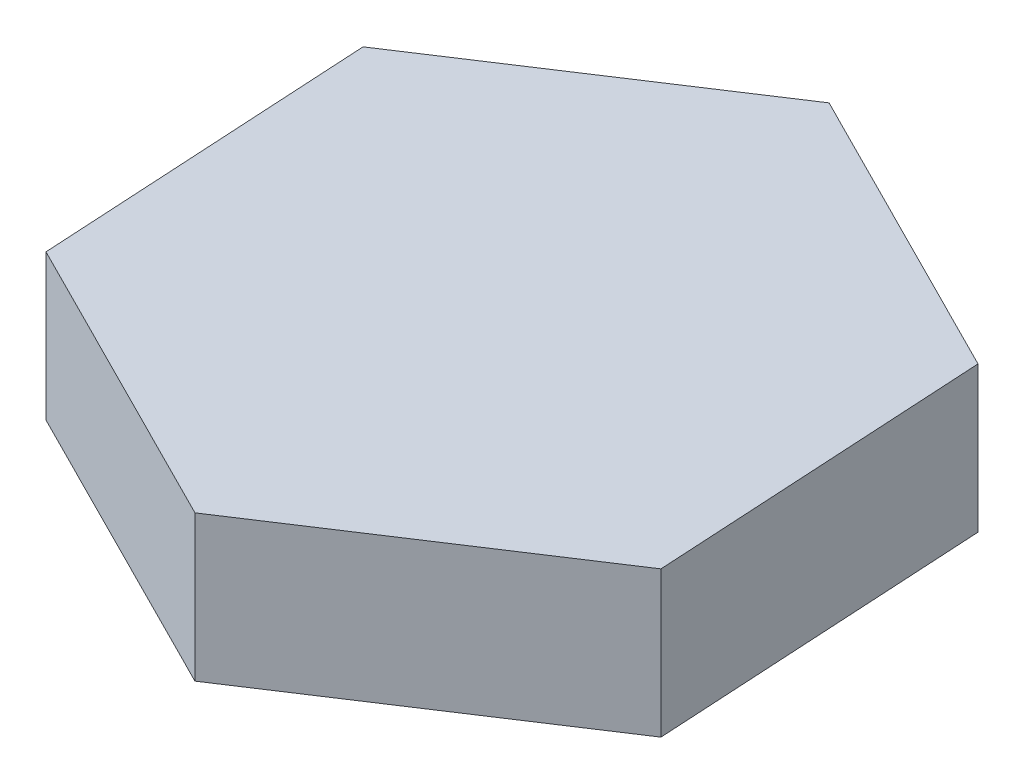
ISO-10303-21;
HEADER;
FILE_DESCRIPTION(('STEP AP214'),'2;1');
FILE_NAME('part.step','',(''),(''),'','','');
FILE_SCHEMA(('AUTOMOTIVE_DESIGN { 1 0 10303 214 1 1 1 1 }'));
ENDSEC;
DATA;
#1=APPLICATION_CONTEXT('core data for automotive mechanical design processes');
#2=APPLICATION_PROTOCOL_DEFINITION('international standard','automotive_design',2000,#1);
#3=PRODUCT_CONTEXT('',#1,'mechanical');
#4=PRODUCT('Part','Part','',(#3));
#5=PRODUCT_RELATED_PRODUCT_CATEGORY('part','',(#4));
#6=PRODUCT_DEFINITION_FORMATION('','',#4);
#7=PRODUCT_DEFINITION_CONTEXT('part definition',#1,'design');
#8=PRODUCT_DEFINITION('design','',#6,#7);
#9=PRODUCT_DEFINITION_SHAPE('','',#8);
#10=(LENGTH_UNIT() NAMED_UNIT(*) SI_UNIT(.MILLI.,.METRE.));
#11=(NAMED_UNIT(*) PLANE_ANGLE_UNIT() SI_UNIT($,.RADIAN.));
#12=(NAMED_UNIT(*) SI_UNIT($,.STERADIAN.) SOLID_ANGLE_UNIT());
#13=UNCERTAINTY_MEASURE_WITH_UNIT(LENGTH_MEASURE(1.E-05),#10,'distance_accuracy_value','');
#14=(GEOMETRIC_REPRESENTATION_CONTEXT(3) GLOBAL_UNCERTAINTY_ASSIGNED_CONTEXT((#13)) GLOBAL_UNIT_ASSIGNED_CONTEXT((#10,
#11,#12)) REPRESENTATION_CONTEXT('',''));
#15=CARTESIAN_POINT('',(0.,0.,0.));
#16=DIRECTION('',(0.,0.,1.));
#17=DIRECTION('',(1.,0.,0.));
#18=AXIS2_PLACEMENT_3D('',#15,#16,#17);
#19=CARTESIAN_POINT('',(78.5620604540912,38.1,39.6222495223042));
#20=DIRECTION('',(-0.998405284268621,0.,0.0564525317810732));
#21=DIRECTION('',(0.0564525317810732,0.,0.998405284268622));
#22=AXIS2_PLACEMENT_3D('',#19,#20,#21);
#23=PLANE('',#22);
#24=DIRECTION('',(-0.0564525317810732,0.,-0.998405284268622));
#25=VECTOR('',#24,1.);
#26=CARTESIAN_POINT('',(78.5620604540912,0.,39.6222495223042));
#27=LINE('',#26,#25);
#28=CARTESIAN_POINT('',(78.5620604540912,0.,39.6222495223042));
#29=VERTEX_POINT('',#28);
#30=CARTESIAN_POINT('',(73.5949048684468,0.,-48.2256153657397));
#31=VERTEX_POINT('',#30);
#32=EDGE_CURVE('E118',#29,#31,#27,.T.);
#33=ORIENTED_EDGE('',*,*,#32,.T.);
#34=DIRECTION('',(0.,-1.,0.));
#35=VECTOR('',#34,1.);
#36=CARTESIAN_POINT('',(73.5949048684468,38.1,-48.2256153657397));
#37=LINE('',#36,#35);
#38=CARTESIAN_POINT('',(73.5949048684468,38.1,-48.2256153657397));
#39=VERTEX_POINT('',#38);
#40=EDGE_CURVE('E11',#39,#31,#37,.T.);
#41=ORIENTED_EDGE('',*,*,#40,.F.);
#42=DIRECTION('',(-0.0564525317810732,0.,-0.998405284268622));
#43=VECTOR('',#42,1.);
#44=CARTESIAN_POINT('',(78.5620604540912,38.1,39.6222495223042));
#45=LINE('',#44,#43);
#46=CARTESIAN_POINT('',(78.5620604540912,38.1,39.6222495223042));
#47=VERTEX_POINT('',#46);
#48=EDGE_CURVE('E129',#47,#39,#45,.T.);
#49=ORIENTED_EDGE('',*,*,#48,.F.);
#50=DIRECTION('',(0.,-1.,0.));
#51=VECTOR('',#50,1.);
#52=CARTESIAN_POINT('',(78.5620604540912,38.1,39.6222495223042));
#53=LINE('',#52,#51);
#54=EDGE_CURVE('E114',#47,#29,#53,.T.);
#55=ORIENTED_EDGE('',*,*,#54,.T.);
#56=EDGE_LOOP('',(#33,#41,#49,#55));
#57=FACE_BOUND('',#56,.T.);
#58=ADVANCED_FACE('F34',(#57),#23,.F.);
#59=CARTESIAN_POINT('',(73.5949048684468,38.1,-48.2256153657397));
#60=DIRECTION('',(-0.450313315503953,0.,0.892870605339787));
#61=DIRECTION('',(0.892870605339787,0.,0.450313315503953));
#62=AXIS2_PLACEMENT_3D('',#59,#60,#61);
#63=PLANE('',#62);
#64=DIRECTION('',(-0.892870605339787,0.,-0.450313315503953));
#65=VECTOR('',#64,1.);
#66=CARTESIAN_POINT('',(73.5949048684468,0.,-48.2256153657397));
#67=LINE('',#66,#65);
#68=CARTESIAN_POINT('',(-4.96715558564432,0.,-87.8478648880439));
#69=VERTEX_POINT('',#68);
#70=EDGE_CURVE('E121',#31,#69,#67,.T.);
#71=ORIENTED_EDGE('',*,*,#70,.T.);
#72=DIRECTION('',(0.,-1.,0.));
#73=VECTOR('',#72,1.);
#74=CARTESIAN_POINT('',(-4.96715558564432,38.1,-87.8478648880439));
#75=LINE('',#74,#73);
#76=CARTESIAN_POINT('',(-4.96715558564432,38.1,-87.8478648880439));
#77=VERTEX_POINT('',#76);
#78=EDGE_CURVE('E42',#77,#69,#75,.T.);
#79=ORIENTED_EDGE('',*,*,#78,.F.);
#80=DIRECTION('',(-0.892870605339787,0.,-0.450313315503953));
#81=VECTOR('',#80,1.);
#82=CARTESIAN_POINT('',(73.5949048684468,38.1,-48.2256153657397));
#83=LINE('',#82,#81);
#84=EDGE_CURVE('E87',#39,#77,#83,.T.);
#85=ORIENTED_EDGE('',*,*,#84,.F.);
#86=ORIENTED_EDGE('',*,*,#40,.T.);
#87=EDGE_LOOP('',(#71,#79,#85,#86));
#88=FACE_BOUND('',#87,.T.);
#89=ADVANCED_FACE('F153',(#88),#63,.F.);
#90=CARTESIAN_POINT('',(-4.96715558564432,38.1,-87.8478648880439));
#91=DIRECTION('',(0.548091968764669,0.,0.836418073558713));
#92=DIRECTION('',(0.836418073558713,0.,-0.548091968764669));
#93=AXIS2_PLACEMENT_3D('',#90,#91,#92);
#94=PLANE('',#93);
#95=DIRECTION('',(-0.836418073558713,0.,0.548091968764669));
#96=VECTOR('',#95,1.);
#97=CARTESIAN_POINT('',(-4.96715558564432,0.,-87.8478648880439));
#98=LINE('',#97,#96);
#99=CARTESIAN_POINT('',(-78.5620604540912,0.,-39.6222495223041));
#100=VERTEX_POINT('',#99);
#101=EDGE_CURVE('E124',#69,#100,#98,.T.);
#102=ORIENTED_EDGE('',*,*,#101,.T.);
#103=DIRECTION('',(0.,-1.,0.));
#104=VECTOR('',#103,1.);
#105=CARTESIAN_POINT('',(-78.5620604540912,38.1,-39.6222495223041));
#106=LINE('',#105,#104);
#107=CARTESIAN_POINT('',(-78.5620604540912,38.1,-39.6222495223041));
#108=VERTEX_POINT('',#107);
#109=EDGE_CURVE('E109',#108,#100,#106,.T.);
#110=ORIENTED_EDGE('',*,*,#109,.F.);
#111=DIRECTION('',(-0.836418073558713,0.,0.548091968764669));
#112=VECTOR('',#111,1.);
#113=CARTESIAN_POINT('',(-4.96715558564432,38.1,-87.8478648880439));
#114=LINE('',#113,#112);
#115=EDGE_CURVE('E100',#77,#108,#114,.T.);
#116=ORIENTED_EDGE('',*,*,#115,.F.);
#117=ORIENTED_EDGE('',*,*,#78,.T.);
#118=EDGE_LOOP('',(#102,#110,#116,#117));
#119=FACE_BOUND('',#118,.T.);
#120=ADVANCED_FACE('F135',(#119),#94,.F.);
#121=CARTESIAN_POINT('',(-78.5620604540912,38.1,-39.6222495223041));
#122=DIRECTION('',(0.998405284268621,0.,-0.0564525317810734));
#123=DIRECTION('',(-0.0564525317810734,0.,-0.998405284268622));
#124=AXIS2_PLACEMENT_3D('',#121,#122,#123);
#125=PLANE('',#124);
#126=DIRECTION('',(0.0564525317810734,0.,0.998405284268622));
#127=VECTOR('',#126,1.);
#128=CARTESIAN_POINT('',(-78.5620604540912,0.,-39.6222495223041));
#129=LINE('',#128,#127);
#130=CARTESIAN_POINT('',(-73.5949048684468,0.,48.2256153657397));
#131=VERTEX_POINT('',#130);
#132=EDGE_CURVE('E108',#100,#131,#129,.T.);
#133=ORIENTED_EDGE('',*,*,#132,.T.);
#134=DIRECTION('',(0.,-1.,0.));
#135=VECTOR('',#134,1.);
#136=CARTESIAN_POINT('',(-73.5949048684468,38.1,48.2256153657397));
#137=LINE('',#136,#135);
#138=CARTESIAN_POINT('',(-73.5949048684468,38.1,48.2256153657397));
#139=VERTEX_POINT('',#138);
#140=EDGE_CURVE('E105',#139,#131,#137,.T.);
#141=ORIENTED_EDGE('',*,*,#140,.F.);
#142=DIRECTION('',(0.0564525317810734,0.,0.998405284268622));
#143=VECTOR('',#142,1.);
#144=CARTESIAN_POINT('',(-78.5620604540912,38.1,-39.6222495223041));
#145=LINE('',#144,#143);
#146=EDGE_CURVE('E94',#108,#139,#145,.T.);
#147=ORIENTED_EDGE('',*,*,#146,.F.);
#148=ORIENTED_EDGE('',*,*,#109,.T.);
#149=EDGE_LOOP('',(#133,#141,#147,#148));
#150=FACE_BOUND('',#149,.T.);
#151=ADVANCED_FACE('F106',(#150),#125,.F.);
#152=CARTESIAN_POINT('',(-73.5949048684468,38.1,48.2256153657397));
#153=DIRECTION('',(0.450313315503953,0.,-0.892870605339787));
#154=DIRECTION('',(-0.892870605339787,0.,-0.450313315503953));
#155=AXIS2_PLACEMENT_3D('',#152,#153,#154);
#156=PLANE('',#155);
#157=DIRECTION('',(0.892870605339787,0.,0.450313315503953));
#158=VECTOR('',#157,1.);
#159=CARTESIAN_POINT('',(-73.5949048684468,0.,48.2256153657397));
#160=LINE('',#159,#158);
#161=CARTESIAN_POINT('',(4.96715558564433,0.,87.8478648880439));
#162=VERTEX_POINT('',#161);
#163=EDGE_CURVE('E73',#131,#162,#160,.T.);
#164=ORIENTED_EDGE('',*,*,#163,.T.);
#165=DIRECTION('',(0.,-1.,0.));
#166=VECTOR('',#165,1.);
#167=CARTESIAN_POINT('',(4.96715558564433,38.1,87.8478648880439));
#168=LINE('',#167,#166);
#169=CARTESIAN_POINT('',(4.96715558564433,38.1,87.8478648880439));
#170=VERTEX_POINT('',#169);
#171=EDGE_CURVE('E110',#170,#162,#168,.T.);
#172=ORIENTED_EDGE('',*,*,#171,.F.);
#173=DIRECTION('',(0.892870605339787,0.,0.450313315503953));
#174=VECTOR('',#173,1.);
#175=CARTESIAN_POINT('',(-73.5949048684468,38.1,48.2256153657397));
#176=LINE('',#175,#174);
#177=EDGE_CURVE('E98',#139,#170,#176,.T.);
#178=ORIENTED_EDGE('',*,*,#177,.F.);
#179=ORIENTED_EDGE('',*,*,#140,.T.);
#180=EDGE_LOOP('',(#164,#172,#178,#179));
#181=FACE_BOUND('',#180,.T.);
#182=ADVANCED_FACE('F112',(#181),#156,.F.);
#183=CARTESIAN_POINT('',(4.96715558564433,38.1,87.8478648880439));
#184=DIRECTION('',(-0.548091968764668,0.,-0.836418073558714));
#185=DIRECTION('',(-0.836418073558714,0.,0.548091968764668));
#186=AXIS2_PLACEMENT_3D('',#183,#184,#185);
#187=PLANE('',#186);
#188=DIRECTION('',(0.836418073558714,0.,-0.548091968764668));
#189=VECTOR('',#188,1.);
#190=CARTESIAN_POINT('',(4.96715558564433,0.,87.8478648880439));
#191=LINE('',#190,#189);
#192=EDGE_CURVE('E79',#162,#29,#191,.T.);
#193=ORIENTED_EDGE('',*,*,#192,.T.);
#194=ORIENTED_EDGE('',*,*,#54,.F.);
#195=DIRECTION('',(0.836418073558714,0.,-0.548091968764668));
#196=VECTOR('',#195,1.);
#197=CARTESIAN_POINT('',(4.96715558564433,38.1,87.8478648880439));
#198=LINE('',#197,#196);
#199=EDGE_CURVE('E50',#170,#47,#198,.T.);
#200=ORIENTED_EDGE('',*,*,#199,.F.);
#201=ORIENTED_EDGE('',*,*,#171,.T.);
#202=EDGE_LOOP('',(#193,#194,#200,#201));
#203=FACE_BOUND('',#202,.T.);
#204=ADVANCED_FACE('F142',(#203),#187,.F.);
#205=CARTESIAN_POINT('',(0.,38.1,0.));
#206=DIRECTION('',(0.,1.,0.));
#207=DIRECTION('',(0.,0.,1.));
#208=AXIS2_PLACEMENT_3D('',#205,#206,#207);
#209=PLANE('',#208);
#210=ORIENTED_EDGE('',*,*,#48,.T.);
#211=ORIENTED_EDGE('',*,*,#84,.T.);
#212=ORIENTED_EDGE('',*,*,#115,.T.);
#213=ORIENTED_EDGE('',*,*,#146,.T.);
#214=ORIENTED_EDGE('',*,*,#177,.T.);
#215=ORIENTED_EDGE('',*,*,#199,.T.);
#216=EDGE_LOOP('',(#210,#211,#212,#213,#214,#215));
#217=FACE_BOUND('',#216,.T.);
#218=ADVANCED_FACE('F96',(#217),#209,.T.);
#219=CARTESIAN_POINT('',(0.,0.,0.));
#220=DIRECTION('',(0.,1.,0.));
#221=DIRECTION('',(0.,0.,1.));
#222=AXIS2_PLACEMENT_3D('',#219,#220,#221);
#223=PLANE('',#222);
#224=CARTESIAN_POINT('',(0.,0.,0.));
#225=DIRECTION('',(0.,-1.,0.));
#226=DIRECTION('',(0.,0.,-1.));
#227=AXIS2_PLACEMENT_3D('',#224,#225,#226);
#228=CIRCLE('',#227,12.7);
#229=CARTESIAN_POINT('',(0.,0.,-12.7));
#230=VERTEX_POINT('',#229);
#231=EDGE_CURVE('E215',#230,#230,#228,.T.);
#232=ORIENTED_EDGE('',*,*,#231,.F.);
#233=EDGE_LOOP('',(#232));
#234=FACE_BOUND('',#233,.T.);
#235=ORIENTED_EDGE('',*,*,#32,.F.);
#236=ORIENTED_EDGE('',*,*,#192,.F.);
#237=ORIENTED_EDGE('',*,*,#163,.F.);
#238=ORIENTED_EDGE('',*,*,#132,.F.);
#239=ORIENTED_EDGE('',*,*,#101,.F.);
#240=ORIENTED_EDGE('',*,*,#70,.F.);
#241=EDGE_LOOP('',(#235,#236,#237,#238,#239,#240));
#242=FACE_BOUND('',#241,.T.);
#243=ADVANCED_FACE('F138',(#234,#242),#223,.F.);
#244=CARTESIAN_POINT('',(0.,12.7,0.));
#245=DIRECTION('',(0.,-1.,0.));
#246=DIRECTION('',(0.,0.,-1.));
#247=AXIS2_PLACEMENT_3D('',#244,#245,#246);
#248=CYLINDRICAL_SURFACE('',#247,12.7);
#249=CARTESIAN_POINT('',(0.,12.7,0.));
#250=DIRECTION('',(0.,-1.,0.));
#251=DIRECTION('',(0.,0.,-1.));
#252=AXIS2_PLACEMENT_3D('',#249,#250,#251);
#253=CIRCLE('',#252,12.7);
#254=CARTESIAN_POINT('',(0.,12.7,-12.7));
#255=VERTEX_POINT('',#254);
#256=EDGE_CURVE('E122',#255,#255,#253,.T.);
#257=ORIENTED_EDGE('',*,*,#256,.F.);
#258=EDGE_LOOP('',(#257));
#259=FACE_BOUND('',#258,.T.);
#260=ORIENTED_EDGE('',*,*,#231,.T.);
#261=EDGE_LOOP('',(#260));
#262=FACE_BOUND('',#261,.T.);
#263=ADVANCED_FACE('F190',(#259,#262),#248,.F.);
#264=CARTESIAN_POINT('',(0.,12.7,0.));
#265=DIRECTION('',(0.,-1.,0.));
#266=DIRECTION('',(0.,0.,-1.));
#267=AXIS2_PLACEMENT_3D('',#264,#265,#266);
#268=PLANE('',#267);
#269=ORIENTED_EDGE('',*,*,#256,.T.);
#270=EDGE_LOOP('',(#269));
#271=FACE_BOUND('',#270,.T.);
#272=ADVANCED_FACE('F199',(#271),#268,.T.);
#273=CLOSED_SHELL('',(#58,#89,#120,#151,#182,#204,#218,#243,#263,#272));
#274=MANIFOLD_SOLID_BREP('B2',#273);
#275=ADVANCED_BREP_SHAPE_REPRESENTATION('',(#18,#274),#14);
#276=SHAPE_DEFINITION_REPRESENTATION(#9,#275);
ENDSEC;
END-ISO-10303-21;
